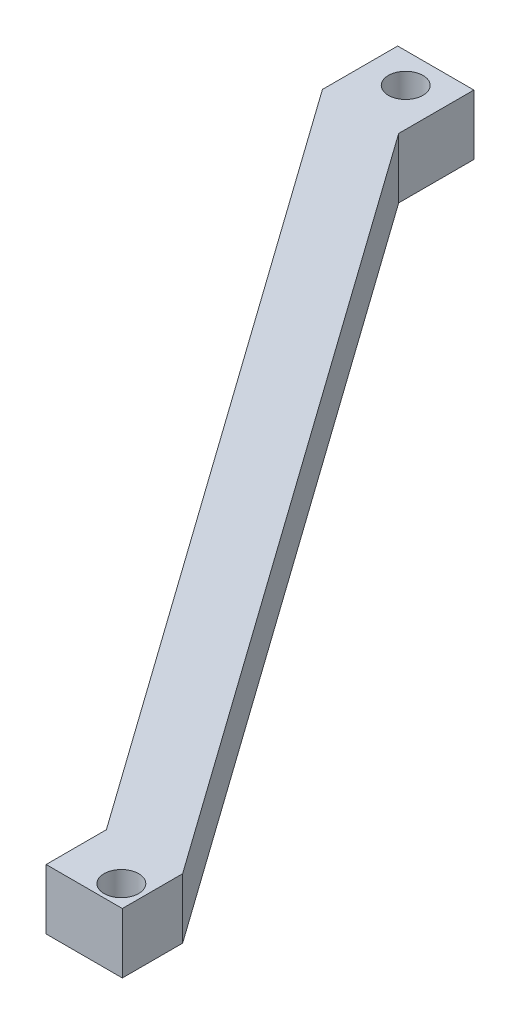
ISO-10303-21;
HEADER;
FILE_DESCRIPTION(('STEP AP214'),'2;1');
FILE_NAME('part.step','',(''),(''),'','','');
FILE_SCHEMA(('AUTOMOTIVE_DESIGN { 1 0 10303 214 1 1 1 1 }'));
ENDSEC;
DATA;
#1=APPLICATION_CONTEXT('core data for automotive mechanical design processes');
#2=APPLICATION_PROTOCOL_DEFINITION('international standard','automotive_design',2000,#1);
#3=PRODUCT_CONTEXT('',#1,'mechanical');
#4=PRODUCT('Part','Part','',(#3));
#5=PRODUCT_RELATED_PRODUCT_CATEGORY('part','',(#4));
#6=PRODUCT_DEFINITION_FORMATION('','',#4);
#7=PRODUCT_DEFINITION_CONTEXT('part definition',#1,'design');
#8=PRODUCT_DEFINITION('design','',#6,#7);
#9=PRODUCT_DEFINITION_SHAPE('','',#8);
#10=(LENGTH_UNIT() NAMED_UNIT(*) SI_UNIT(.MILLI.,.METRE.));
#11=(NAMED_UNIT(*) PLANE_ANGLE_UNIT() SI_UNIT($,.RADIAN.));
#12=(NAMED_UNIT(*) SI_UNIT($,.STERADIAN.) SOLID_ANGLE_UNIT());
#13=UNCERTAINTY_MEASURE_WITH_UNIT(LENGTH_MEASURE(1.E-05),#10,'distance_accuracy_value','');
#14=(GEOMETRIC_REPRESENTATION_CONTEXT(3) GLOBAL_UNCERTAINTY_ASSIGNED_CONTEXT((#13)) GLOBAL_UNIT_ASSIGNED_CONTEXT((#10,
#11,#12)) REPRESENTATION_CONTEXT('',''));
#15=CARTESIAN_POINT('',(0.,0.,0.));
#16=DIRECTION('',(0.,0.,1.));
#17=DIRECTION('',(1.,0.,0.));
#18=AXIS2_PLACEMENT_3D('',#15,#16,#17);
#19=CARTESIAN_POINT('',(12.6661796259949,20.,-10.));
#20=DIRECTION('',(0.,0.,1.));
#21=DIRECTION('',(1.,0.,0.));
#22=AXIS2_PLACEMENT_3D('',#19,#20,#21);
#23=PLANE('',#22);
#24=DIRECTION('',(-1.,0.,0.));
#25=VECTOR('',#24,1.);
#26=CARTESIAN_POINT('',(12.6661796259949,0.,-10.));
#27=LINE('',#26,#25);
#28=CARTESIAN_POINT('',(12.6661796259949,0.,-10.));
#29=VERTEX_POINT('',#28);
#30=CARTESIAN_POINT('',(-12.6661796259949,0.,-10.));
#31=VERTEX_POINT('',#30);
#32=EDGE_CURVE('E135',#29,#31,#27,.T.);
#33=ORIENTED_EDGE('',*,*,#32,.T.);
#34=DIRECTION('',(0.,-1.,0.));
#35=VECTOR('',#34,1.);
#36=CARTESIAN_POINT('',(-12.6661796259949,20.,-10.));
#37=LINE('',#36,#35);
#38=CARTESIAN_POINT('',(-12.6661796259949,20.,-10.));
#39=VERTEX_POINT('',#38);
#40=EDGE_CURVE('E11',#39,#31,#37,.T.);
#41=ORIENTED_EDGE('',*,*,#40,.F.);
#42=DIRECTION('',(-1.,0.,0.));
#43=VECTOR('',#42,1.);
#44=CARTESIAN_POINT('',(12.6661796259949,20.,-10.));
#45=LINE('',#44,#43);
#46=CARTESIAN_POINT('',(12.6661796259949,20.,-10.));
#47=VERTEX_POINT('',#46);
#48=EDGE_CURVE('E150',#47,#39,#45,.T.);
#49=ORIENTED_EDGE('',*,*,#48,.F.);
#50=DIRECTION('',(0.,-1.,0.));
#51=VECTOR('',#50,1.);
#52=CARTESIAN_POINT('',(12.6661796259949,20.,-10.));
#53=LINE('',#52,#51);
#54=EDGE_CURVE('E131',#47,#29,#53,.T.);
#55=ORIENTED_EDGE('',*,*,#54,.T.);
#56=EDGE_LOOP('',(#33,#41,#49,#55));
#57=FACE_BOUND('',#56,.T.);
#58=ADVANCED_FACE('F39',(#57),#23,.F.);
#59=CARTESIAN_POINT('',(-12.6661796259949,20.,-10.));
#60=DIRECTION('',(1.,0.,0.));
#61=DIRECTION('',(0.,0.,-1.));
#62=AXIS2_PLACEMENT_3D('',#59,#60,#61);
#63=PLANE('',#62);
#64=DIRECTION('',(0.,0.,1.));
#65=VECTOR('',#64,1.);
#66=CARTESIAN_POINT('',(-12.6661796259949,0.,-10.));
#67=LINE('',#66,#65);
#68=CARTESIAN_POINT('',(-12.6661796259949,0.,15.));
#69=VERTEX_POINT('',#68);
#70=EDGE_CURVE('E138',#31,#69,#67,.T.);
#71=ORIENTED_EDGE('',*,*,#70,.T.);
#72=DIRECTION('',(0.,-1.,0.));
#73=VECTOR('',#72,1.);
#74=CARTESIAN_POINT('',(-12.6661796259949,20.,15.));
#75=LINE('',#74,#73);
#76=CARTESIAN_POINT('',(-12.6661796259949,20.,15.));
#77=VERTEX_POINT('',#76);
#78=EDGE_CURVE('E47',#77,#69,#75,.T.);
#79=ORIENTED_EDGE('',*,*,#78,.F.);
#80=DIRECTION('',(0.,0.,1.));
#81=VECTOR('',#80,1.);
#82=CARTESIAN_POINT('',(-12.6661796259949,20.,-10.));
#83=LINE('',#82,#81);
#84=EDGE_CURVE('E98',#39,#77,#83,.T.);
#85=ORIENTED_EDGE('',*,*,#84,.F.);
#86=ORIENTED_EDGE('',*,*,#40,.T.);
#87=EDGE_LOOP('',(#71,#79,#85,#86));
#88=FACE_BOUND('',#87,.T.);
#89=ADVANCED_FACE('F219',(#88),#63,.F.);
#90=CARTESIAN_POINT('',(-12.6661796259949,20.,15.));
#91=DIRECTION('',(0.814766107715458,0.,-0.579789780625877));
#92=DIRECTION('',(-0.579789780625877,0.,-0.814766107715458));
#93=AXIS2_PLACEMENT_3D('',#90,#91,#92);
#94=PLANE('',#93);
#95=DIRECTION('',(0.579789780625877,0.,0.814766107715458));
#96=VECTOR('',#95,1.);
#97=CARTESIAN_POINT('',(-12.6661796259949,0.,15.));
#98=LINE('',#97,#96);
#99=CARTESIAN_POINT('',(164.47805617935,0.,263.936984290317));
#100=VERTEX_POINT('',#99);
#101=EDGE_CURVE('E141',#69,#100,#98,.T.);
#102=ORIENTED_EDGE('',*,*,#101,.T.);
#103=DIRECTION('',(0.,-1.,0.));
#104=VECTOR('',#103,1.);
#105=CARTESIAN_POINT('',(164.47805617935,20.,263.936984290317));
#106=LINE('',#105,#104);
#107=CARTESIAN_POINT('',(164.47805617935,20.,263.936984290317));
#108=VERTEX_POINT('',#107);
#109=EDGE_CURVE('E157',#108,#100,#106,.T.);
#110=ORIENTED_EDGE('',*,*,#109,.F.);
#111=DIRECTION('',(0.579789780625877,0.,0.814766107715458));
#112=VECTOR('',#111,1.);
#113=CARTESIAN_POINT('',(-12.6661796259949,20.,15.));
#114=LINE('',#113,#112);
#115=EDGE_CURVE('E165',#77,#108,#114,.T.);
#116=ORIENTED_EDGE('',*,*,#115,.F.);
#117=ORIENTED_EDGE('',*,*,#78,.T.);
#118=EDGE_LOOP('',(#102,#110,#116,#117));
#119=FACE_BOUND('',#118,.T.);
#120=ADVANCED_FACE('F163',(#119),#94,.F.);
#121=CARTESIAN_POINT('',(164.47805617935,20.,263.936984290317));
#122=DIRECTION('',(1.,0.,0.));
#123=DIRECTION('',(0.,0.,-1.));
#124=AXIS2_PLACEMENT_3D('',#121,#122,#123);
#125=PLANE('',#124);
#126=DIRECTION('',(0.,0.,1.));
#127=VECTOR('',#126,1.);
#128=CARTESIAN_POINT('',(164.47805617935,0.,263.936984290317));
#129=LINE('',#128,#127);
#130=CARTESIAN_POINT('',(164.47805617935,0.,283.967221838402));
#131=VERTEX_POINT('',#130);
#132=EDGE_CURVE('E143',#100,#131,#129,.T.);
#133=ORIENTED_EDGE('',*,*,#132,.T.);
#134=DIRECTION('',(0.,-1.,0.));
#135=VECTOR('',#134,1.);
#136=CARTESIAN_POINT('',(164.47805617935,20.,283.967221838402));
#137=LINE('',#136,#135);
#138=CARTESIAN_POINT('',(164.47805617935,20.,283.967221838402));
#139=VERTEX_POINT('',#138);
#140=EDGE_CURVE('E154',#139,#131,#137,.T.);
#141=ORIENTED_EDGE('',*,*,#140,.F.);
#142=DIRECTION('',(0.,0.,1.));
#143=VECTOR('',#142,1.);
#144=CARTESIAN_POINT('',(164.47805617935,20.,263.936984290317));
#145=LINE('',#144,#143);
#146=EDGE_CURVE('E177',#108,#139,#145,.T.);
#147=ORIENTED_EDGE('',*,*,#146,.F.);
#148=ORIENTED_EDGE('',*,*,#109,.T.);
#149=EDGE_LOOP('',(#133,#141,#147,#148));
#150=FACE_BOUND('',#149,.T.);
#151=ADVANCED_FACE('F173',(#150),#125,.F.);
#152=CARTESIAN_POINT('',(164.47805617935,20.,283.967221838402));
#153=DIRECTION('',(0.,0.,-1.));
#154=DIRECTION('',(-1.,0.,0.));
#155=AXIS2_PLACEMENT_3D('',#152,#153,#154);
#156=PLANE('',#155);
#157=DIRECTION('',(1.,0.,0.));
#158=VECTOR('',#157,1.);
#159=CARTESIAN_POINT('',(164.47805617935,0.,283.967221838402));
#160=LINE('',#159,#158);
#161=CARTESIAN_POINT('',(189.81041543134,0.,283.967221838402));
#162=VERTEX_POINT('',#161);
#163=EDGE_CURVE('E145',#131,#162,#160,.T.);
#164=ORIENTED_EDGE('',*,*,#163,.T.);
#165=DIRECTION('',(0.,-1.,0.));
#166=VECTOR('',#165,1.);
#167=CARTESIAN_POINT('',(189.81041543134,20.,283.967221838402));
#168=LINE('',#167,#166);
#169=CARTESIAN_POINT('',(189.81041543134,20.,283.967221838402));
#170=VERTEX_POINT('',#169);
#171=EDGE_CURVE('E126',#170,#162,#168,.T.);
#172=ORIENTED_EDGE('',*,*,#171,.F.);
#173=DIRECTION('',(1.,0.,0.));
#174=VECTOR('',#173,1.);
#175=CARTESIAN_POINT('',(164.47805617935,20.,283.967221838402));
#176=LINE('',#175,#174);
#177=EDGE_CURVE('E117',#139,#170,#176,.T.);
#178=ORIENTED_EDGE('',*,*,#177,.F.);
#179=ORIENTED_EDGE('',*,*,#140,.T.);
#180=EDGE_LOOP('',(#164,#172,#178,#179));
#181=FACE_BOUND('',#180,.T.);
#182=ADVANCED_FACE('F176',(#181),#156,.F.);
#183=CARTESIAN_POINT('',(189.81041543134,20.,283.967221838402));
#184=DIRECTION('',(-1.,0.,0.));
#185=DIRECTION('',(0.,0.,1.));
#186=AXIS2_PLACEMENT_3D('',#183,#184,#185);
#187=PLANE('',#186);
#188=DIRECTION('',(0.,0.,-1.));
#189=VECTOR('',#188,1.);
#190=CARTESIAN_POINT('',(189.81041543134,0.,283.967221838402));
#191=LINE('',#190,#189);
#192=CARTESIAN_POINT('',(189.81041543134,0.,263.936984290317));
#193=VERTEX_POINT('',#192);
#194=EDGE_CURVE('E125',#162,#193,#191,.T.);
#195=ORIENTED_EDGE('',*,*,#194,.T.);
#196=DIRECTION('',(0.,-1.,0.));
#197=VECTOR('',#196,1.);
#198=CARTESIAN_POINT('',(189.81041543134,20.,263.936984290317));
#199=LINE('',#198,#197);
#200=CARTESIAN_POINT('',(189.81041543134,20.,263.936984290317));
#201=VERTEX_POINT('',#200);
#202=EDGE_CURVE('E122',#201,#193,#199,.T.);
#203=ORIENTED_EDGE('',*,*,#202,.F.);
#204=DIRECTION('',(0.,0.,-1.));
#205=VECTOR('',#204,1.);
#206=CARTESIAN_POINT('',(189.81041543134,20.,283.967221838402));
#207=LINE('',#206,#205);
#208=EDGE_CURVE('E111',#170,#201,#207,.T.);
#209=ORIENTED_EDGE('',*,*,#208,.F.);
#210=ORIENTED_EDGE('',*,*,#171,.T.);
#211=EDGE_LOOP('',(#195,#203,#209,#210));
#212=FACE_BOUND('',#211,.T.);
#213=ADVANCED_FACE('F123',(#212),#187,.F.);
#214=CARTESIAN_POINT('',(189.81041543134,20.,263.936984290317));
#215=DIRECTION('',(-0.814766107715458,0.,0.579789780625877));
#216=DIRECTION('',(0.579789780625877,0.,0.814766107715458));
#217=AXIS2_PLACEMENT_3D('',#214,#215,#216);
#218=PLANE('',#217);
#219=DIRECTION('',(-0.579789780625877,0.,-0.814766107715458));
#220=VECTOR('',#219,1.);
#221=CARTESIAN_POINT('',(189.81041543134,0.,263.936984290317));
#222=LINE('',#221,#220);
#223=CARTESIAN_POINT('',(12.6661796259949,0.,15.));
#224=VERTEX_POINT('',#223);
#225=EDGE_CURVE('E84',#193,#224,#222,.T.);
#226=ORIENTED_EDGE('',*,*,#225,.T.);
#227=DIRECTION('',(0.,-1.,0.));
#228=VECTOR('',#227,1.);
#229=CARTESIAN_POINT('',(12.6661796259949,20.,15.));
#230=LINE('',#229,#228);
#231=CARTESIAN_POINT('',(12.6661796259949,20.,15.));
#232=VERTEX_POINT('',#231);
#233=EDGE_CURVE('E127',#232,#224,#230,.T.);
#234=ORIENTED_EDGE('',*,*,#233,.F.);
#235=DIRECTION('',(-0.579789780625877,0.,-0.814766107715458));
#236=VECTOR('',#235,1.);
#237=CARTESIAN_POINT('',(189.81041543134,20.,263.936984290317));
#238=LINE('',#237,#236);
#239=EDGE_CURVE('E115',#201,#232,#238,.T.);
#240=ORIENTED_EDGE('',*,*,#239,.F.);
#241=ORIENTED_EDGE('',*,*,#202,.T.);
#242=EDGE_LOOP('',(#226,#234,#240,#241));
#243=FACE_BOUND('',#242,.T.);
#244=ADVANCED_FACE('F129',(#243),#218,.F.);
#245=CARTESIAN_POINT('',(12.6661796259949,20.,15.));
#246=DIRECTION('',(-1.,0.,0.));
#247=DIRECTION('',(0.,0.,1.));
#248=AXIS2_PLACEMENT_3D('',#245,#246,#247);
#249=PLANE('',#248);
#250=DIRECTION('',(0.,0.,-1.));
#251=VECTOR('',#250,1.);
#252=CARTESIAN_POINT('',(12.6661796259949,0.,15.));
#253=LINE('',#252,#251);
#254=EDGE_CURVE('E90',#224,#29,#253,.T.);
#255=ORIENTED_EDGE('',*,*,#254,.T.);
#256=ORIENTED_EDGE('',*,*,#54,.F.);
#257=DIRECTION('',(0.,0.,-1.));
#258=VECTOR('',#257,1.);
#259=CARTESIAN_POINT('',(12.6661796259949,20.,15.));
#260=LINE('',#259,#258);
#261=EDGE_CURVE('E55',#232,#47,#260,.T.);
#262=ORIENTED_EDGE('',*,*,#261,.F.);
#263=ORIENTED_EDGE('',*,*,#233,.T.);
#264=EDGE_LOOP('',(#255,#256,#262,#263));
#265=FACE_BOUND('',#264,.T.);
#266=ADVANCED_FACE('F206',(#265),#249,.F.);
#267=CARTESIAN_POINT('',(0.,20.,0.));
#268=DIRECTION('',(0.,1.,0.));
#269=DIRECTION('',(0.,0.,1.));
#270=AXIS2_PLACEMENT_3D('',#267,#268,#269);
#271=PLANE('',#270);
#272=CARTESIAN_POINT('',(0.,20.,0.));
#273=DIRECTION('',(0.,1.,0.));
#274=DIRECTION('',(0.,0.,1.));
#275=AXIS2_PLACEMENT_3D('',#272,#273,#274);
#276=CIRCLE('',#275,5.75);
#277=CARTESIAN_POINT('',(0.,20.,5.75));
#278=VERTEX_POINT('',#277);
#279=EDGE_CURVE('E189',#278,#278,#276,.T.);
#280=ORIENTED_EDGE('',*,*,#279,.F.);
#281=EDGE_LOOP('',(#280));
#282=FACE_BOUND('',#281,.T.);
#283=CARTESIAN_POINT('',(182.47805617935,20.,276.967221838402));
#284=DIRECTION('',(0.,1.,0.));
#285=DIRECTION('',(0.,0.,1.));
#286=AXIS2_PLACEMENT_3D('',#283,#284,#285);
#287=CIRCLE('',#286,5.75);
#288=CARTESIAN_POINT('',(182.47805617935,20.,282.717221838402));
#289=VERTEX_POINT('',#288);
#290=EDGE_CURVE('E183',#289,#289,#287,.T.);
#291=ORIENTED_EDGE('',*,*,#290,.F.);
#292=EDGE_LOOP('',(#291));
#293=FACE_BOUND('',#292,.T.);
#294=ORIENTED_EDGE('',*,*,#48,.T.);
#295=ORIENTED_EDGE('',*,*,#84,.T.);
#296=ORIENTED_EDGE('',*,*,#115,.T.);
#297=ORIENTED_EDGE('',*,*,#146,.T.);
#298=ORIENTED_EDGE('',*,*,#177,.T.);
#299=ORIENTED_EDGE('',*,*,#208,.T.);
#300=ORIENTED_EDGE('',*,*,#239,.T.);
#301=ORIENTED_EDGE('',*,*,#261,.T.);
#302=EDGE_LOOP('',(#294,#295,#296,#297,#298,#299,#300,#301));
#303=FACE_BOUND('',#302,.T.);
#304=ADVANCED_FACE('F113',(#282,#293,#303),#271,.T.);
#305=CARTESIAN_POINT('',(0.,0.,0.));
#306=DIRECTION('',(0.,1.,0.));
#307=DIRECTION('',(0.,0.,1.));
#308=AXIS2_PLACEMENT_3D('',#305,#306,#307);
#309=PLANE('',#308);
#310=CARTESIAN_POINT('',(0.,0.,0.));
#311=DIRECTION('',(0.,1.,0.));
#312=DIRECTION('',(0.,0.,1.));
#313=AXIS2_PLACEMENT_3D('',#310,#311,#312);
#314=CIRCLE('',#313,5.75);
#315=CARTESIAN_POINT('',(0.,0.,5.75));
#316=VERTEX_POINT('',#315);
#317=EDGE_CURVE('E139',#316,#316,#314,.T.);
#318=ORIENTED_EDGE('',*,*,#317,.T.);
#319=EDGE_LOOP('',(#318));
#320=FACE_BOUND('',#319,.T.);
#321=CARTESIAN_POINT('',(182.47805617935,0.,276.967221838402));
#322=DIRECTION('',(0.,1.,0.));
#323=DIRECTION('',(0.,0.,1.));
#324=AXIS2_PLACEMENT_3D('',#321,#322,#323);
#325=CIRCLE('',#324,5.75);
#326=CARTESIAN_POINT('',(182.47805617935,0.,282.717221838402));
#327=VERTEX_POINT('',#326);
#328=EDGE_CURVE('E186',#327,#327,#325,.T.);
#329=ORIENTED_EDGE('',*,*,#328,.T.);
#330=EDGE_LOOP('',(#329));
#331=FACE_BOUND('',#330,.T.);
#332=ORIENTED_EDGE('',*,*,#32,.F.);
#333=ORIENTED_EDGE('',*,*,#254,.F.);
#334=ORIENTED_EDGE('',*,*,#225,.F.);
#335=ORIENTED_EDGE('',*,*,#194,.F.);
#336=ORIENTED_EDGE('',*,*,#163,.F.);
#337=ORIENTED_EDGE('',*,*,#132,.F.);
#338=ORIENTED_EDGE('',*,*,#101,.F.);
#339=ORIENTED_EDGE('',*,*,#70,.F.);
#340=EDGE_LOOP('',(#332,#333,#334,#335,#336,#337,#338,#339));
#341=FACE_BOUND('',#340,.T.);
#342=ADVANCED_FACE('F169',(#320,#331,#341),#309,.F.);
#343=CARTESIAN_POINT('',(182.47805617935,0.,276.967221838402));
#344=DIRECTION('',(0.,1.,0.));
#345=DIRECTION('',(0.,0.,1.));
#346=AXIS2_PLACEMENT_3D('',#343,#344,#345);
#347=CYLINDRICAL_SURFACE('',#346,5.75);
#348=ORIENTED_EDGE('',*,*,#328,.F.);
#349=EDGE_LOOP('',(#348));
#350=FACE_BOUND('',#349,.T.);
#351=ORIENTED_EDGE('',*,*,#290,.T.);
#352=EDGE_LOOP('',(#351));
#353=FACE_BOUND('',#352,.T.);
#354=ADVANCED_FACE('F200',(#350,#353),#347,.F.);
#355=CARTESIAN_POINT('',(0.,0.,0.));
#356=DIRECTION('',(0.,1.,0.));
#357=DIRECTION('',(0.,0.,1.));
#358=AXIS2_PLACEMENT_3D('',#355,#356,#357);
#359=CYLINDRICAL_SURFACE('',#358,5.75);
#360=ORIENTED_EDGE('',*,*,#317,.F.);
#361=EDGE_LOOP('',(#360));
#362=FACE_BOUND('',#361,.T.);
#363=ORIENTED_EDGE('',*,*,#279,.T.);
#364=EDGE_LOOP('',(#363));
#365=FACE_BOUND('',#364,.T.);
#366=ADVANCED_FACE('F197',(#362,#365),#359,.F.);
#367=CLOSED_SHELL('',(#58,#89,#120,#151,#182,#213,#244,#266,#304,#342,#354,#366));
#368=MANIFOLD_SOLID_BREP('B2',#367);
#369=ADVANCED_BREP_SHAPE_REPRESENTATION('',(#18,#368),#14);
#370=SHAPE_DEFINITION_REPRESENTATION(#9,#369);
ENDSEC;
END-ISO-10303-21;
